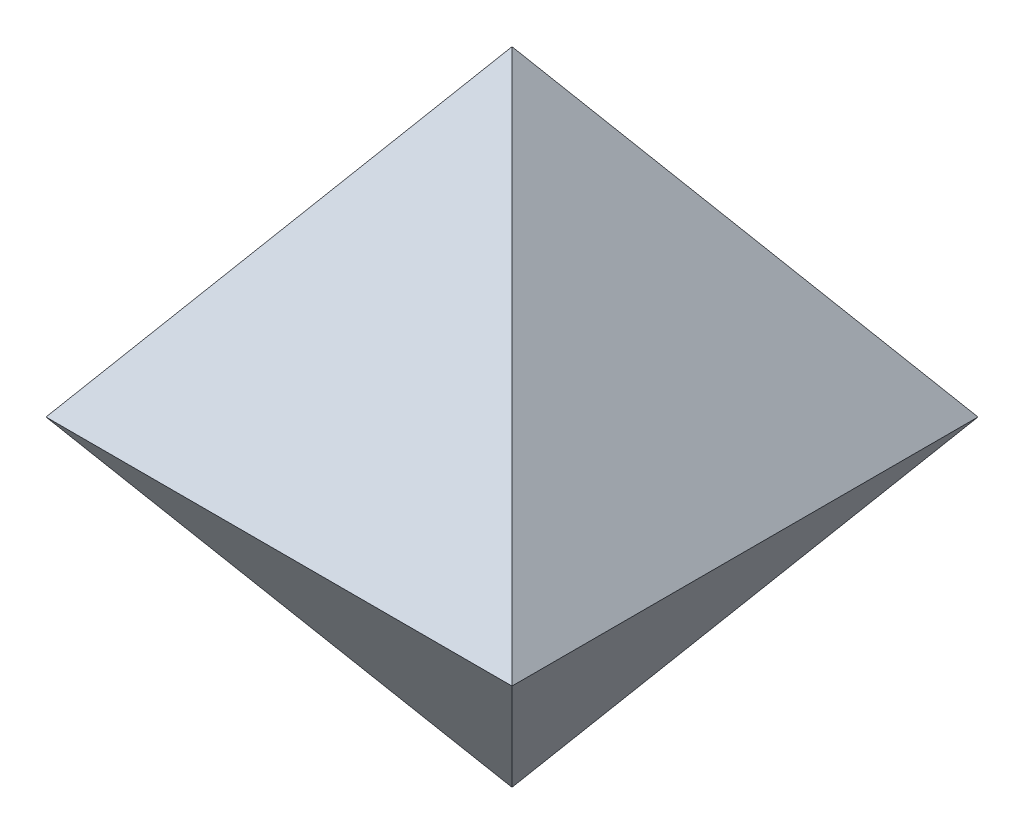
ISO-10303-21;
HEADER;
FILE_DESCRIPTION(('STEP AP214'),'2;1');
FILE_NAME('part.step','',(''),(''),'','','');
FILE_SCHEMA(('AUTOMOTIVE_DESIGN { 1 0 10303 214 1 1 1 1 }'));
ENDSEC;
DATA;
#1=APPLICATION_CONTEXT('core data for automotive mechanical design processes');
#2=APPLICATION_PROTOCOL_DEFINITION('international standard','automotive_design',2000,#1);
#3=PRODUCT_CONTEXT('',#1,'mechanical');
#4=PRODUCT('Part','Part','',(#3));
#5=PRODUCT_RELATED_PRODUCT_CATEGORY('part','',(#4));
#6=PRODUCT_DEFINITION_FORMATION('','',#4);
#7=PRODUCT_DEFINITION_CONTEXT('part definition',#1,'design');
#8=PRODUCT_DEFINITION('design','',#6,#7);
#9=PRODUCT_DEFINITION_SHAPE('','',#8);
#10=(LENGTH_UNIT() NAMED_UNIT(*) SI_UNIT(.MILLI.,.METRE.));
#11=(NAMED_UNIT(*) PLANE_ANGLE_UNIT() SI_UNIT($,.RADIAN.));
#12=(NAMED_UNIT(*) SI_UNIT($,.STERADIAN.) SOLID_ANGLE_UNIT());
#13=UNCERTAINTY_MEASURE_WITH_UNIT(LENGTH_MEASURE(1.E-05),#10,'distance_accuracy_value','');
#14=(GEOMETRIC_REPRESENTATION_CONTEXT(3) GLOBAL_UNCERTAINTY_ASSIGNED_CONTEXT((#13)) GLOBAL_UNIT_ASSIGNED_CONTEXT((#10,
#11,#12)) REPRESENTATION_CONTEXT('',''));
#15=CARTESIAN_POINT('',(0.,0.,0.));
#16=DIRECTION('',(0.,0.,1.));
#17=DIRECTION('',(1.,0.,0.));
#18=AXIS2_PLACEMENT_3D('',#15,#16,#17);
#19=CARTESIAN_POINT('',(-0.5,0.,0.5));
#20=DIRECTION('',(-0.809016994374947,0.587785252292474,0.));
#21=DIRECTION('',(-0.587785252292474,-0.809016994374947,0.));
#22=AXIS2_PLACEMENT_3D('',#19,#20,#21);
#23=PLANE('',#22);
#24=DIRECTION('',(0.,0.,1.));
#25=VECTOR('',#24,1.);
#26=CARTESIAN_POINT('',(-0.5,0.,0.5));
#27=LINE('',#26,#25);
#28=CARTESIAN_POINT('',(-0.5,0.,-0.5));
#29=VERTEX_POINT('',#28);
#30=CARTESIAN_POINT('',(-0.5,0.,0.5));
#31=VERTEX_POINT('',#30);
#32=EDGE_CURVE('E78',#29,#31,#27,.T.);
#33=ORIENTED_EDGE('',*,*,#32,.T.);
#34=DIRECTION('',(-0.506731853971387,-0.697456562333054,0.506731853971387));
#35=VECTOR('',#34,1.);
#36=CARTESIAN_POINT('',(-0.243222828170721,0.353423456895539,0.243222828170721));
#37=LINE('',#36,#35);
#38=CARTESIAN_POINT('',(0.,0.688190960235585,0.));
#39=VERTEX_POINT('',#38);
#40=EDGE_CURVE('E11',#39,#31,#37,.T.);
#41=ORIENTED_EDGE('',*,*,#40,.F.);
#42=DIRECTION('',(-0.506731853971387,-0.697456562333054,-0.506731853971387));
#43=VECTOR('',#42,1.);
#44=CARTESIAN_POINT('',(-0.243222828170721,0.353423456895539,-0.243222828170721));
#45=LINE('',#44,#43);
#46=EDGE_CURVE('E91',#39,#29,#45,.T.);
#47=ORIENTED_EDGE('',*,*,#46,.T.);
#48=EDGE_LOOP('',(#33,#41,#47));
#49=FACE_BOUND('',#48,.T.);
#50=ADVANCED_FACE('F33',(#49),#23,.T.);
#51=CARTESIAN_POINT('',(0.5,0.,0.5));
#52=DIRECTION('',(0.,0.587785252292474,0.809016994374947));
#53=DIRECTION('',(0.,-0.809016994374947,0.587785252292474));
#54=AXIS2_PLACEMENT_3D('',#51,#52,#53);
#55=PLANE('',#54);
#56=DIRECTION('',(1.,0.,0.));
#57=VECTOR('',#56,1.);
#58=CARTESIAN_POINT('',(0.5,0.,0.5));
#59=LINE('',#58,#57);
#60=CARTESIAN_POINT('',(0.5,0.,0.5));
#61=VERTEX_POINT('',#60);
#62=EDGE_CURVE('E88',#31,#61,#59,.T.);
#63=ORIENTED_EDGE('',*,*,#62,.T.);
#64=DIRECTION('',(0.506731853971387,-0.697456562333054,0.506731853971387));
#65=VECTOR('',#64,1.);
#66=CARTESIAN_POINT('',(0.5,0.,0.5));
#67=LINE('',#66,#65);
#68=EDGE_CURVE('E37',#39,#61,#67,.T.);
#69=ORIENTED_EDGE('',*,*,#68,.F.);
#70=ORIENTED_EDGE('',*,*,#40,.T.);
#71=EDGE_LOOP('',(#63,#69,#70));
#72=FACE_BOUND('',#71,.T.);
#73=ADVANCED_FACE('F35',(#72),#55,.T.);
#74=CARTESIAN_POINT('',(0.5,0.,0.5));
#75=DIRECTION('',(0.809016994374947,0.587785252292474,0.));
#76=DIRECTION('',(-0.587785252292474,0.809016994374947,0.));
#77=AXIS2_PLACEMENT_3D('',#74,#75,#76);
#78=PLANE('',#77);
#79=DIRECTION('',(0.,0.,-1.));
#80=VECTOR('',#79,1.);
#81=CARTESIAN_POINT('',(0.5,0.,0.5));
#82=LINE('',#81,#80);
#83=CARTESIAN_POINT('',(0.5,0.,-0.5));
#84=VERTEX_POINT('',#83);
#85=EDGE_CURVE('E55',#61,#84,#82,.T.);
#86=ORIENTED_EDGE('',*,*,#85,.T.);
#87=DIRECTION('',(0.506731853971387,-0.697456562333054,-0.506731853971387));
#88=VECTOR('',#87,1.);
#89=CARTESIAN_POINT('',(0.5,0.,-0.5));
#90=LINE('',#89,#88);
#91=EDGE_CURVE('E93',#39,#84,#90,.T.);
#92=ORIENTED_EDGE('',*,*,#91,.F.);
#93=ORIENTED_EDGE('',*,*,#68,.T.);
#94=EDGE_LOOP('',(#86,#92,#93));
#95=FACE_BOUND('',#94,.T.);
#96=ADVANCED_FACE('F100',(#95),#78,.T.);
#97=CARTESIAN_POINT('',(0.5,0.,-0.5));
#98=DIRECTION('',(0.,0.587785252292474,-0.809016994374947));
#99=DIRECTION('',(0.,0.809016994374947,0.587785252292474));
#100=AXIS2_PLACEMENT_3D('',#97,#98,#99);
#101=PLANE('',#100);
#102=DIRECTION('',(-1.,0.,0.));
#103=VECTOR('',#102,1.);
#104=CARTESIAN_POINT('',(0.5,0.,-0.5));
#105=LINE('',#104,#103);
#106=EDGE_CURVE('E74',#84,#29,#105,.T.);
#107=ORIENTED_EDGE('',*,*,#106,.T.);
#108=ORIENTED_EDGE('',*,*,#46,.F.);
#109=ORIENTED_EDGE('',*,*,#91,.T.);
#110=EDGE_LOOP('',(#107,#108,#109));
#111=FACE_BOUND('',#110,.T.);
#112=ADVANCED_FACE('F95',(#111),#101,.T.);
#113=CARTESIAN_POINT('',(-0.5,0.,0.5));
#114=DIRECTION('',(-0.809016994374947,-0.587785252292474,0.));
#115=DIRECTION('',(0.587785252292474,-0.809016994374947,0.));
#116=AXIS2_PLACEMENT_3D('',#113,#114,#115);
#117=PLANE('',#116);
#118=ORIENTED_EDGE('',*,*,#32,.F.);
#119=DIRECTION('',(-0.506731853971387,0.697456562333054,-0.506731853971387));
#120=VECTOR('',#119,1.);
#121=CARTESIAN_POINT('',(-0.243222828170721,-0.353423456895539,-0.243222828170721));
#122=LINE('',#121,#120);
#123=CARTESIAN_POINT('',(0.,-0.688190960235585,0.));
#124=VERTEX_POINT('',#123);
#125=EDGE_CURVE('E70',#124,#29,#122,.T.);
#126=ORIENTED_EDGE('',*,*,#125,.F.);
#127=DIRECTION('',(-0.506731853971387,0.697456562333054,0.506731853971387));
#128=VECTOR('',#127,1.);
#129=CARTESIAN_POINT('',(-0.5,0.,0.5));
#130=LINE('',#129,#128);
#131=EDGE_CURVE('E84',#124,#31,#130,.T.);
#132=ORIENTED_EDGE('',*,*,#131,.T.);
#133=EDGE_LOOP('',(#118,#126,#132));
#134=FACE_BOUND('',#133,.T.);
#135=ADVANCED_FACE('F82',(#134),#117,.T.);
#136=CARTESIAN_POINT('',(0.5,0.,-0.5));
#137=DIRECTION('',(0.,-0.587785252292474,-0.809016994374947));
#138=DIRECTION('',(0.,0.809016994374947,-0.587785252292474));
#139=AXIS2_PLACEMENT_3D('',#136,#137,#138);
#140=PLANE('',#139);
#141=ORIENTED_EDGE('',*,*,#106,.F.);
#142=DIRECTION('',(0.506731853971387,0.697456562333054,-0.506731853971387));
#143=VECTOR('',#142,1.);
#144=CARTESIAN_POINT('',(0.243222828170721,-0.353423456895539,-0.243222828170721));
#145=LINE('',#144,#143);
#146=EDGE_CURVE('E76',#124,#84,#145,.T.);
#147=ORIENTED_EDGE('',*,*,#146,.F.);
#148=ORIENTED_EDGE('',*,*,#125,.T.);
#149=EDGE_LOOP('',(#141,#147,#148));
#150=FACE_BOUND('',#149,.T.);
#151=ADVANCED_FACE('F72',(#150),#140,.T.);
#152=CARTESIAN_POINT('',(0.5,0.,0.5));
#153=DIRECTION('',(0.809016994374947,-0.587785252292474,0.));
#154=DIRECTION('',(0.587785252292474,0.809016994374947,0.));
#155=AXIS2_PLACEMENT_3D('',#152,#153,#154);
#156=PLANE('',#155);
#157=ORIENTED_EDGE('',*,*,#85,.F.);
#158=DIRECTION('',(0.506731853971387,0.697456562333054,0.506731853971387));
#159=VECTOR('',#158,1.);
#160=CARTESIAN_POINT('',(0.5,0.,0.5));
#161=LINE('',#160,#159);
#162=EDGE_CURVE('E104',#124,#61,#161,.T.);
#163=ORIENTED_EDGE('',*,*,#162,.F.);
#164=ORIENTED_EDGE('',*,*,#146,.T.);
#165=EDGE_LOOP('',(#157,#163,#164));
#166=FACE_BOUND('',#165,.T.);
#167=ADVANCED_FACE('F107',(#166),#156,.T.);
#168=CARTESIAN_POINT('',(0.5,0.,0.5));
#169=DIRECTION('',(0.,-0.587785252292474,0.809016994374947));
#170=DIRECTION('',(0.,-0.809016994374947,-0.587785252292474));
#171=AXIS2_PLACEMENT_3D('',#168,#169,#170);
#172=PLANE('',#171);
#173=ORIENTED_EDGE('',*,*,#62,.F.);
#174=ORIENTED_EDGE('',*,*,#131,.F.);
#175=ORIENTED_EDGE('',*,*,#162,.T.);
#176=EDGE_LOOP('',(#173,#174,#175));
#177=FACE_BOUND('',#176,.T.);
#178=ADVANCED_FACE('F106',(#177),#172,.T.);
#179=CLOSED_SHELL('',(#50,#73,#96,#112,#135,#151,#167,#178));
#180=MANIFOLD_SOLID_BREP('B2',#179);
#181=ADVANCED_BREP_SHAPE_REPRESENTATION('',(#18,#180),#14);
#182=SHAPE_DEFINITION_REPRESENTATION(#9,#181);
ENDSEC;
END-ISO-10303-21;
